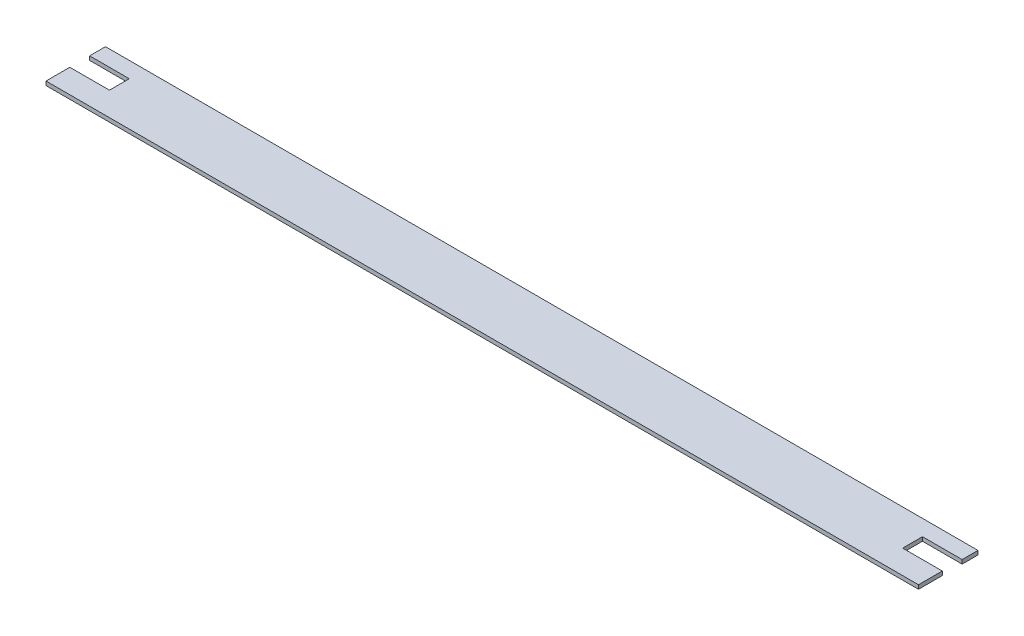
ISO-10303-21;
HEADER;
FILE_DESCRIPTION(('STEP AP214'),'2;1');
FILE_NAME('part.step','',(''),(''),'','','');
FILE_SCHEMA(('AUTOMOTIVE_DESIGN { 1 0 10303 214 1 1 1 1 }'));
ENDSEC;
DATA;
#1=APPLICATION_CONTEXT('core data for automotive mechanical design processes');
#2=APPLICATION_PROTOCOL_DEFINITION('international standard','automotive_design',2000,#1);
#3=PRODUCT_CONTEXT('',#1,'mechanical');
#4=PRODUCT('Part','Part','',(#3));
#5=PRODUCT_RELATED_PRODUCT_CATEGORY('part','',(#4));
#6=PRODUCT_DEFINITION_FORMATION('','',#4);
#7=PRODUCT_DEFINITION_CONTEXT('part definition',#1,'design');
#8=PRODUCT_DEFINITION('design','',#6,#7);
#9=PRODUCT_DEFINITION_SHAPE('','',#8);
#10=(LENGTH_UNIT() NAMED_UNIT(*) SI_UNIT(.MILLI.,.METRE.));
#11=(NAMED_UNIT(*) PLANE_ANGLE_UNIT() SI_UNIT($,.RADIAN.));
#12=(NAMED_UNIT(*) SI_UNIT($,.STERADIAN.) SOLID_ANGLE_UNIT());
#13=UNCERTAINTY_MEASURE_WITH_UNIT(LENGTH_MEASURE(1.E-05),#10,'distance_accuracy_value','');
#14=(GEOMETRIC_REPRESENTATION_CONTEXT(3) GLOBAL_UNCERTAINTY_ASSIGNED_CONTEXT((#13)) GLOBAL_UNIT_ASSIGNED_CONTEXT((#10,
#11,#12)) REPRESENTATION_CONTEXT('',''));
#15=CARTESIAN_POINT('',(0.,0.,0.));
#16=DIRECTION('',(0.,0.,1.));
#17=DIRECTION('',(1.,0.,0.));
#18=AXIS2_PLACEMENT_3D('',#15,#16,#17);
#19=CARTESIAN_POINT('',(597.266258042068,0.,0.));
#20=DIRECTION('',(1.,0.,0.));
#21=DIRECTION('',(0.,0.,-1.));
#22=AXIS2_PLACEMENT_3D('',#19,#20,#21);
#23=PLANE('',#22);
#24=DIRECTION('',(0.,1.,0.));
#25=VECTOR('',#24,1.);
#26=CARTESIAN_POINT('',(597.266258042068,-45.,25.));
#27=LINE('',#26,#25);
#28=CARTESIAN_POINT('',(597.266258042068,-50.,25.));
#29=VERTEX_POINT('',#28);
#30=CARTESIAN_POINT('',(597.266258042068,-45.,25.));
#31=VERTEX_POINT('',#30);
#32=EDGE_CURVE('E240',#29,#31,#27,.T.);
#33=ORIENTED_EDGE('',*,*,#32,.F.);
#34=DIRECTION('',(0.,0.,-1.));
#35=VECTOR('',#34,1.);
#36=CARTESIAN_POINT('',(597.266258042068,-50.,80.));
#37=LINE('',#36,#35);
#38=CARTESIAN_POINT('',(597.266258042068,-50.,5.));
#39=VERTEX_POINT('',#38);
#40=EDGE_CURVE('E41',#29,#39,#37,.T.);
#41=ORIENTED_EDGE('',*,*,#40,.T.);
#42=DIRECTION('',(0.,1.,0.));
#43=VECTOR('',#42,1.);
#44=CARTESIAN_POINT('',(597.266258042068,0.,5.));
#45=LINE('',#44,#43);
#46=CARTESIAN_POINT('',(597.266258042068,-45.,5.));
#47=VERTEX_POINT('',#46);
#48=EDGE_CURVE('E192',#39,#47,#45,.T.);
#49=ORIENTED_EDGE('',*,*,#48,.T.);
#50=DIRECTION('',(0.,0.,-1.));
#51=VECTOR('',#50,1.);
#52=CARTESIAN_POINT('',(597.266258042068,-45.,80.));
#53=LINE('',#52,#51);
#54=EDGE_CURVE('E183',#31,#47,#53,.T.);
#55=ORIENTED_EDGE('',*,*,#54,.F.);
#56=EDGE_LOOP('',(#33,#41,#49,#55));
#57=FACE_BOUND('',#56,.T.);
#58=ADVANCED_FACE('F32',(#57),#23,.T.);
#59=CARTESIAN_POINT('',(-502.733741957931,0.,0.));
#60=DIRECTION('',(1.,0.,0.));
#61=DIRECTION('',(0.,0.,-1.));
#62=AXIS2_PLACEMENT_3D('',#59,#60,#61);
#63=PLANE('',#62);
#64=DIRECTION('',(0.,0.,-1.));
#65=VECTOR('',#64,1.);
#66=CARTESIAN_POINT('',(-502.733741957931,-50.,80.));
#67=LINE('',#66,#65);
#68=CARTESIAN_POINT('',(-502.733741957931,-50.,25.));
#69=VERTEX_POINT('',#68);
#70=CARTESIAN_POINT('',(-502.733741957931,-50.,5.));
#71=VERTEX_POINT('',#70);
#72=EDGE_CURVE('E189',#69,#71,#67,.T.);
#73=ORIENTED_EDGE('',*,*,#72,.F.);
#74=DIRECTION('',(0.,-1.,0.));
#75=VECTOR('',#74,1.);
#76=CARTESIAN_POINT('',(-502.733741957931,-45.,25.));
#77=LINE('',#76,#75);
#78=CARTESIAN_POINT('',(-502.733741957931,-45.,25.));
#79=VERTEX_POINT('',#78);
#80=EDGE_CURVE('E160',#79,#69,#77,.T.);
#81=ORIENTED_EDGE('',*,*,#80,.F.);
#82=DIRECTION('',(0.,0.,1.));
#83=VECTOR('',#82,1.);
#84=CARTESIAN_POINT('',(-502.733741957931,-45.,80.));
#85=LINE('',#84,#83);
#86=CARTESIAN_POINT('',(-502.733741957931,-45.,5.));
#87=VERTEX_POINT('',#86);
#88=EDGE_CURVE('E186',#79,#87,#85,.F.);
#89=ORIENTED_EDGE('',*,*,#88,.T.);
#90=DIRECTION('',(0.,1.,0.));
#91=VECTOR('',#90,1.);
#92=CARTESIAN_POINT('',(-502.733741957931,0.,5.));
#93=LINE('',#92,#91);
#94=EDGE_CURVE('E36',#71,#87,#93,.T.);
#95=ORIENTED_EDGE('',*,*,#94,.F.);
#96=EDGE_LOOP('',(#73,#81,#89,#95));
#97=FACE_BOUND('',#96,.T.);
#98=ADVANCED_FACE('F208',(#97),#63,.F.);
#99=CARTESIAN_POINT('',(0.,0.,5.));
#100=DIRECTION('',(0.,0.,-1.));
#101=DIRECTION('',(-1.,0.,0.));
#102=AXIS2_PLACEMENT_3D('',#99,#100,#101);
#103=PLANE('',#102);
#104=DIRECTION('',(-1.,0.,0.));
#105=VECTOR('',#104,1.);
#106=CARTESIAN_POINT('',(-502.733741957931,-50.,5.));
#107=LINE('',#106,#105);
#108=EDGE_CURVE('E197',#39,#71,#107,.T.);
#109=ORIENTED_EDGE('',*,*,#108,.T.);
#110=ORIENTED_EDGE('',*,*,#94,.T.);
#111=DIRECTION('',(-1.,0.,0.));
#112=VECTOR('',#111,1.);
#113=CARTESIAN_POINT('',(-502.733741957931,-45.,5.));
#114=LINE('',#113,#112);
#115=EDGE_CURVE('E195',#47,#87,#114,.T.);
#116=ORIENTED_EDGE('',*,*,#115,.F.);
#117=ORIENTED_EDGE('',*,*,#48,.F.);
#118=EDGE_LOOP('',(#109,#110,#116,#117));
#119=FACE_BOUND('',#118,.T.);
#120=ADVANCED_FACE('F205',(#119),#103,.T.);
#121=CARTESIAN_POINT('',(-502.733741957931,-50.,80.));
#122=DIRECTION('',(0.,1.,0.));
#123=DIRECTION('',(0.,0.,1.));
#124=AXIS2_PLACEMENT_3D('',#121,#122,#123);
#125=PLANE('',#124);
#126=ORIENTED_EDGE('',*,*,#40,.F.);
#127=DIRECTION('',(1.,0.,0.));
#128=VECTOR('',#127,1.);
#129=CARTESIAN_POINT('',(547.266258042068,-50.,25.));
#130=LINE('',#129,#128);
#131=CARTESIAN_POINT('',(547.266258042068,-50.,25.));
#132=VERTEX_POINT('',#131);
#133=EDGE_CURVE('E145',#132,#29,#130,.T.);
#134=ORIENTED_EDGE('',*,*,#133,.F.);
#135=DIRECTION('',(0.,0.,-1.));
#136=VECTOR('',#135,1.);
#137=CARTESIAN_POINT('',(547.266258042068,-50.,25.));
#138=LINE('',#137,#136);
#139=CARTESIAN_POINT('',(547.266258042068,-50.,50.));
#140=VERTEX_POINT('',#139);
#141=EDGE_CURVE('E132',#140,#132,#138,.T.);
#142=ORIENTED_EDGE('',*,*,#141,.F.);
#143=DIRECTION('',(1.,0.,0.));
#144=VECTOR('',#143,1.);
#145=CARTESIAN_POINT('',(547.266258042068,-50.,50.));
#146=LINE('',#145,#144);
#147=CARTESIAN_POINT('',(597.266258042068,-50.,50.));
#148=VERTEX_POINT('',#147);
#149=EDGE_CURVE('E130',#140,#148,#146,.T.);
#150=ORIENTED_EDGE('',*,*,#149,.T.);
#151=CARTESIAN_POINT('',(597.266258042068,-50.,80.));
#152=VERTEX_POINT('',#151);
#153=EDGE_CURVE('E11',#152,#148,#37,.T.);
#154=ORIENTED_EDGE('',*,*,#153,.F.);
#155=DIRECTION('',(1.,0.,0.));
#156=VECTOR('',#155,1.);
#157=CARTESIAN_POINT('',(-502.733741957931,-50.,80.));
#158=LINE('',#157,#156);
#159=CARTESIAN_POINT('',(-502.733741957931,-50.,80.));
#160=VERTEX_POINT('',#159);
#161=EDGE_CURVE('E182',#160,#152,#158,.T.);
#162=ORIENTED_EDGE('',*,*,#161,.F.);
#163=CARTESIAN_POINT('',(-502.733741957931,-50.,50.));
#164=VERTEX_POINT('',#163);
#165=EDGE_CURVE('E180',#160,#164,#67,.T.);
#166=ORIENTED_EDGE('',*,*,#165,.T.);
#167=DIRECTION('',(-1.,0.,0.));
#168=VECTOR('',#167,1.);
#169=CARTESIAN_POINT('',(-452.733741957932,-50.,50.));
#170=LINE('',#169,#168);
#171=CARTESIAN_POINT('',(-452.733741957932,-50.,50.));
#172=VERTEX_POINT('',#171);
#173=EDGE_CURVE('E168',#172,#164,#170,.T.);
#174=ORIENTED_EDGE('',*,*,#173,.F.);
#175=DIRECTION('',(0.,0.,1.));
#176=VECTOR('',#175,1.);
#177=CARTESIAN_POINT('',(-452.733741957932,-50.,25.));
#178=LINE('',#177,#176);
#179=CARTESIAN_POINT('',(-452.733741957932,-50.,25.));
#180=VERTEX_POINT('',#179);
#181=EDGE_CURVE('E153',#180,#172,#178,.T.);
#182=ORIENTED_EDGE('',*,*,#181,.F.);
#183=DIRECTION('',(-1.,0.,0.));
#184=VECTOR('',#183,1.);
#185=CARTESIAN_POINT('',(-452.733741957932,-50.,25.));
#186=LINE('',#185,#184);
#187=EDGE_CURVE('E159',#180,#69,#186,.T.);
#188=ORIENTED_EDGE('',*,*,#187,.T.);
#189=ORIENTED_EDGE('',*,*,#72,.T.);
#190=ORIENTED_EDGE('',*,*,#108,.F.);
#191=EDGE_LOOP('',(#126,#134,#142,#150,#154,#162,#166,#174,#182,#188,#189,#190));
#192=FACE_BOUND('',#191,.T.);
#193=ADVANCED_FACE('F217',(#192),#125,.F.);
#194=CARTESIAN_POINT('',(-502.733741957931,0.,80.));
#195=DIRECTION('',(0.,0.,1.));
#196=DIRECTION('',(1.,0.,0.));
#197=AXIS2_PLACEMENT_3D('',#194,#195,#196);
#198=PLANE('',#197);
#199=DIRECTION('',(0.,1.,0.));
#200=VECTOR('',#199,1.);
#201=CARTESIAN_POINT('',(-502.733741957931,0.,80.));
#202=LINE('',#201,#200);
#203=CARTESIAN_POINT('',(-502.733741957931,-45.,80.));
#204=VERTEX_POINT('',#203);
#205=EDGE_CURVE('E172',#160,#204,#202,.T.);
#206=ORIENTED_EDGE('',*,*,#205,.F.);
#207=ORIENTED_EDGE('',*,*,#161,.T.);
#208=DIRECTION('',(0.,1.,0.));
#209=VECTOR('',#208,1.);
#210=CARTESIAN_POINT('',(597.266258042068,0.,80.));
#211=LINE('',#210,#209);
#212=CARTESIAN_POINT('',(597.266258042068,-45.,80.));
#213=VERTEX_POINT('',#212);
#214=EDGE_CURVE('E177',#152,#213,#211,.T.);
#215=ORIENTED_EDGE('',*,*,#214,.T.);
#216=DIRECTION('',(1.,0.,0.));
#217=VECTOR('',#216,1.);
#218=CARTESIAN_POINT('',(-502.733741957931,-45.,80.));
#219=LINE('',#218,#217);
#220=EDGE_CURVE('E174',#204,#213,#219,.T.);
#221=ORIENTED_EDGE('',*,*,#220,.F.);
#222=EDGE_LOOP('',(#206,#207,#215,#221));
#223=FACE_BOUND('',#222,.T.);
#224=ADVANCED_FACE('F233',(#223),#198,.T.);
#225=CARTESIAN_POINT('',(-502.733741957931,-45.,50.));
#226=VERTEX_POINT('',#225);
#227=EDGE_CURVE('E175',#204,#226,#85,.F.);
#228=ORIENTED_EDGE('',*,*,#227,.T.);
#229=DIRECTION('',(0.,1.,0.));
#230=VECTOR('',#229,1.);
#231=CARTESIAN_POINT('',(-502.733741957931,-45.,50.));
#232=LINE('',#231,#230);
#233=EDGE_CURVE('E154',#164,#226,#232,.T.);
#234=ORIENTED_EDGE('',*,*,#233,.F.);
#235=ORIENTED_EDGE('',*,*,#165,.F.);
#236=ORIENTED_EDGE('',*,*,#205,.T.);
#237=EDGE_LOOP('',(#228,#234,#235,#236));
#238=FACE_BOUND('',#237,.T.);
#239=ADVANCED_FACE('F228',(#238),#63,.F.);
#240=DIRECTION('',(0.,-1.,0.));
#241=VECTOR('',#240,1.);
#242=CARTESIAN_POINT('',(597.266258042068,-45.,50.));
#243=LINE('',#242,#241);
#244=CARTESIAN_POINT('',(597.266258042068,-45.,50.));
#245=VERTEX_POINT('',#244);
#246=EDGE_CURVE('E242',#245,#148,#243,.T.);
#247=ORIENTED_EDGE('',*,*,#246,.F.);
#248=EDGE_CURVE('E142',#213,#245,#53,.T.);
#249=ORIENTED_EDGE('',*,*,#248,.F.);
#250=ORIENTED_EDGE('',*,*,#214,.F.);
#251=ORIENTED_EDGE('',*,*,#153,.T.);
#252=EDGE_LOOP('',(#247,#249,#250,#251));
#253=FACE_BOUND('',#252,.T.);
#254=ADVANCED_FACE('F237',(#253),#23,.T.);
#255=CARTESIAN_POINT('',(-502.733741957931,-45.,80.));
#256=DIRECTION('',(0.,1.,0.));
#257=DIRECTION('',(0.,0.,1.));
#258=AXIS2_PLACEMENT_3D('',#255,#256,#257);
#259=PLANE('',#258);
#260=DIRECTION('',(1.,0.,0.));
#261=VECTOR('',#260,1.);
#262=CARTESIAN_POINT('',(547.266258042068,-45.,25.));
#263=LINE('',#262,#261);
#264=CARTESIAN_POINT('',(547.266258042068,-45.,25.));
#265=VERTEX_POINT('',#264);
#266=EDGE_CURVE('E143',#265,#31,#263,.T.);
#267=ORIENTED_EDGE('',*,*,#266,.T.);
#268=ORIENTED_EDGE('',*,*,#54,.T.);
#269=ORIENTED_EDGE('',*,*,#115,.T.);
#270=ORIENTED_EDGE('',*,*,#88,.F.);
#271=DIRECTION('',(-1.,0.,0.));
#272=VECTOR('',#271,1.);
#273=CARTESIAN_POINT('',(-452.733741957932,-45.,25.));
#274=LINE('',#273,#272);
#275=CARTESIAN_POINT('',(-452.733741957932,-45.,25.));
#276=VERTEX_POINT('',#275);
#277=EDGE_CURVE('E163',#276,#79,#274,.T.);
#278=ORIENTED_EDGE('',*,*,#277,.F.);
#279=DIRECTION('',(0.,0.,-1.));
#280=VECTOR('',#279,1.);
#281=CARTESIAN_POINT('',(-452.733741957932,-45.,25.));
#282=LINE('',#281,#280);
#283=CARTESIAN_POINT('',(-452.733741957932,-45.,50.));
#284=VERTEX_POINT('',#283);
#285=EDGE_CURVE('E157',#284,#276,#282,.T.);
#286=ORIENTED_EDGE('',*,*,#285,.F.);
#287=DIRECTION('',(-1.,0.,0.));
#288=VECTOR('',#287,1.);
#289=CARTESIAN_POINT('',(-452.733741957932,-45.,50.));
#290=LINE('',#289,#288);
#291=EDGE_CURVE('E165',#284,#226,#290,.T.);
#292=ORIENTED_EDGE('',*,*,#291,.T.);
#293=ORIENTED_EDGE('',*,*,#227,.F.);
#294=ORIENTED_EDGE('',*,*,#220,.T.);
#295=ORIENTED_EDGE('',*,*,#248,.T.);
#296=DIRECTION('',(1.,0.,0.));
#297=VECTOR('',#296,1.);
#298=CARTESIAN_POINT('',(547.266258042068,-45.,50.));
#299=LINE('',#298,#297);
#300=CARTESIAN_POINT('',(547.266258042068,-45.,50.));
#301=VERTEX_POINT('',#300);
#302=EDGE_CURVE('E127',#301,#245,#299,.T.);
#303=ORIENTED_EDGE('',*,*,#302,.F.);
#304=DIRECTION('',(0.,0.,1.));
#305=VECTOR('',#304,1.);
#306=CARTESIAN_POINT('',(547.266258042068,-45.,25.));
#307=LINE('',#306,#305);
#308=EDGE_CURVE('E133',#265,#301,#307,.T.);
#309=ORIENTED_EDGE('',*,*,#308,.F.);
#310=EDGE_LOOP('',(#267,#268,#269,#270,#278,#286,#292,#293,#294,#295,#303,#309));
#311=FACE_BOUND('',#310,.T.);
#312=ADVANCED_FACE('F34',(#311),#259,.T.);
#313=CARTESIAN_POINT('',(-452.733741957932,-45.,25.));
#314=DIRECTION('',(0.,0.,-1.));
#315=DIRECTION('',(-1.,0.,0.));
#316=AXIS2_PLACEMENT_3D('',#313,#314,#315);
#317=PLANE('',#316);
#318=ORIENTED_EDGE('',*,*,#80,.T.);
#319=ORIENTED_EDGE('',*,*,#187,.F.);
#320=DIRECTION('',(0.,-1.,0.));
#321=VECTOR('',#320,1.);
#322=CARTESIAN_POINT('',(-452.733741957932,-45.,25.));
#323=LINE('',#322,#321);
#324=EDGE_CURVE('E150',#276,#180,#323,.T.);
#325=ORIENTED_EDGE('',*,*,#324,.F.);
#326=ORIENTED_EDGE('',*,*,#277,.T.);
#327=EDGE_LOOP('',(#318,#319,#325,#326));
#328=FACE_BOUND('',#327,.T.);
#329=ADVANCED_FACE('F222',(#328),#317,.F.);
#330=CARTESIAN_POINT('',(-452.733741957932,-45.,50.));
#331=DIRECTION('',(0.,0.,1.));
#332=DIRECTION('',(1.,0.,0.));
#333=AXIS2_PLACEMENT_3D('',#330,#331,#332);
#334=PLANE('',#333);
#335=ORIENTED_EDGE('',*,*,#233,.T.);
#336=ORIENTED_EDGE('',*,*,#291,.F.);
#337=DIRECTION('',(0.,1.,0.));
#338=VECTOR('',#337,1.);
#339=CARTESIAN_POINT('',(-452.733741957932,-45.,50.));
#340=LINE('',#339,#338);
#341=EDGE_CURVE('E57',#172,#284,#340,.T.);
#342=ORIENTED_EDGE('',*,*,#341,.F.);
#343=ORIENTED_EDGE('',*,*,#173,.T.);
#344=EDGE_LOOP('',(#335,#336,#342,#343));
#345=FACE_BOUND('',#344,.T.);
#346=ADVANCED_FACE('F254',(#345),#334,.F.);
#347=CARTESIAN_POINT('',(-452.733741957932,0.,0.));
#348=DIRECTION('',(-1.,0.,0.));
#349=DIRECTION('',(0.,0.,1.));
#350=AXIS2_PLACEMENT_3D('',#347,#348,#349);
#351=PLANE('',#350);
#352=ORIENTED_EDGE('',*,*,#324,.T.);
#353=ORIENTED_EDGE('',*,*,#181,.T.);
#354=ORIENTED_EDGE('',*,*,#341,.T.);
#355=ORIENTED_EDGE('',*,*,#285,.T.);
#356=EDGE_LOOP('',(#352,#353,#354,#355));
#357=FACE_BOUND('',#356,.T.);
#358=ADVANCED_FACE('F223',(#357),#351,.T.);
#359=CARTESIAN_POINT('',(547.266258042068,-45.,25.));
#360=DIRECTION('',(0.,0.,-1.));
#361=DIRECTION('',(-1.,0.,0.));
#362=AXIS2_PLACEMENT_3D('',#359,#360,#361);
#363=PLANE('',#362);
#364=ORIENTED_EDGE('',*,*,#32,.T.);
#365=ORIENTED_EDGE('',*,*,#266,.F.);
#366=DIRECTION('',(0.,1.,0.));
#367=VECTOR('',#366,1.);
#368=CARTESIAN_POINT('',(547.266258042068,-45.,25.));
#369=LINE('',#368,#367);
#370=EDGE_CURVE('E49',#132,#265,#369,.T.);
#371=ORIENTED_EDGE('',*,*,#370,.F.);
#372=ORIENTED_EDGE('',*,*,#133,.T.);
#373=EDGE_LOOP('',(#364,#365,#371,#372));
#374=FACE_BOUND('',#373,.T.);
#375=ADVANCED_FACE('F244',(#374),#363,.F.);
#376=CARTESIAN_POINT('',(547.266258042068,-45.,50.));
#377=DIRECTION('',(0.,0.,1.));
#378=DIRECTION('',(0.,-1.,0.));
#379=AXIS2_PLACEMENT_3D('',#376,#377,#378);
#380=PLANE('',#379);
#381=ORIENTED_EDGE('',*,*,#246,.T.);
#382=ORIENTED_EDGE('',*,*,#149,.F.);
#383=DIRECTION('',(0.,-1.,0.));
#384=VECTOR('',#383,1.);
#385=CARTESIAN_POINT('',(547.266258042068,-45.,50.));
#386=LINE('',#385,#384);
#387=EDGE_CURVE('E124',#301,#140,#386,.T.);
#388=ORIENTED_EDGE('',*,*,#387,.F.);
#389=ORIENTED_EDGE('',*,*,#302,.T.);
#390=EDGE_LOOP('',(#381,#382,#388,#389));
#391=FACE_BOUND('',#390,.T.);
#392=ADVANCED_FACE('F125',(#391),#380,.F.);
#393=CARTESIAN_POINT('',(547.266258042068,0.,0.));
#394=DIRECTION('',(-1.,0.,0.));
#395=DIRECTION('',(0.,0.,1.));
#396=AXIS2_PLACEMENT_3D('',#393,#394,#395);
#397=PLANE('',#396);
#398=ORIENTED_EDGE('',*,*,#370,.T.);
#399=ORIENTED_EDGE('',*,*,#308,.T.);
#400=ORIENTED_EDGE('',*,*,#387,.T.);
#401=ORIENTED_EDGE('',*,*,#141,.T.);
#402=EDGE_LOOP('',(#398,#399,#400,#401));
#403=FACE_BOUND('',#402,.T.);
#404=ADVANCED_FACE('F136',(#403),#397,.F.);
#405=CLOSED_SHELL('',(#58,#98,#120,#193,#224,#239,#254,#312,#329,#346,#358,#375,#392,#404));
#406=MANIFOLD_SOLID_BREP('B2',#405);
#407=ADVANCED_BREP_SHAPE_REPRESENTATION('',(#18,#406),#14);
#408=SHAPE_DEFINITION_REPRESENTATION(#9,#407);
ENDSEC;
END-ISO-10303-21;
